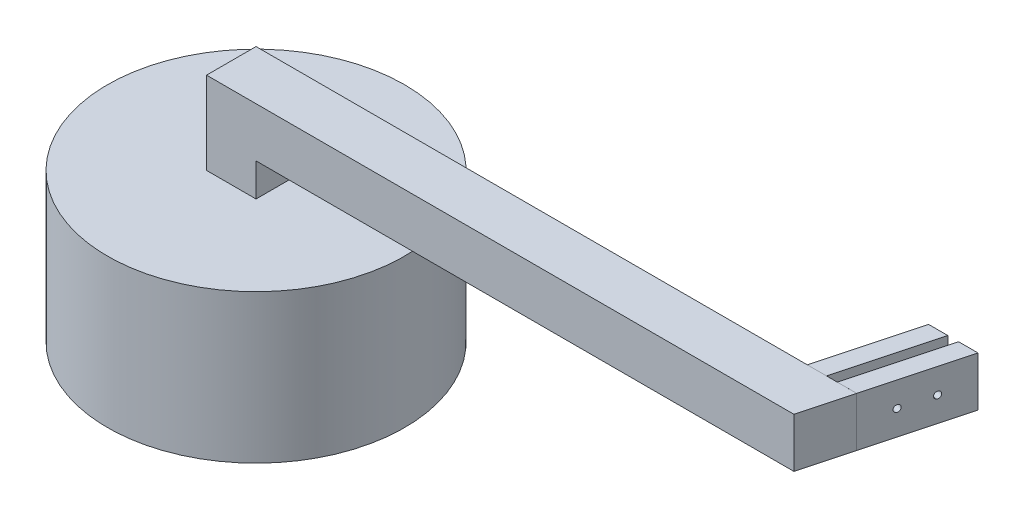
ISO-10303-21;
HEADER;
FILE_DESCRIPTION(('STEP AP214'),'2;1');
FILE_NAME('part.step','',(''),(''),'','','');
FILE_SCHEMA(('AUTOMOTIVE_DESIGN { 1 0 10303 214 1 1 1 1 }'));
ENDSEC;
DATA;
#1=APPLICATION_CONTEXT('core data for automotive mechanical design processes');
#2=APPLICATION_PROTOCOL_DEFINITION('international standard','automotive_design',2000,#1);
#3=PRODUCT_CONTEXT('',#1,'mechanical');
#4=PRODUCT('Part','Part','',(#3));
#5=PRODUCT_RELATED_PRODUCT_CATEGORY('part','',(#4));
#6=PRODUCT_DEFINITION_FORMATION('','',#4);
#7=PRODUCT_DEFINITION_CONTEXT('part definition',#1,'design');
#8=PRODUCT_DEFINITION('design','',#6,#7);
#9=PRODUCT_DEFINITION_SHAPE('','',#8);
#10=(LENGTH_UNIT() NAMED_UNIT(*) SI_UNIT(.MILLI.,.METRE.));
#11=(NAMED_UNIT(*) PLANE_ANGLE_UNIT() SI_UNIT($,.RADIAN.));
#12=(NAMED_UNIT(*) SI_UNIT($,.STERADIAN.) SOLID_ANGLE_UNIT());
#13=UNCERTAINTY_MEASURE_WITH_UNIT(LENGTH_MEASURE(1.E-05),#10,'distance_accuracy_value','');
#14=(GEOMETRIC_REPRESENTATION_CONTEXT(3) GLOBAL_UNCERTAINTY_ASSIGNED_CONTEXT((#13)) GLOBAL_UNIT_ASSIGNED_CONTEXT((#10,
#11,#12)) REPRESENTATION_CONTEXT('',''));
#15=CARTESIAN_POINT('',(0.,0.,0.));
#16=DIRECTION('',(0.,0.,1.));
#17=DIRECTION('',(1.,0.,0.));
#18=AXIS2_PLACEMENT_3D('',#15,#16,#17);
#19=CARTESIAN_POINT('',(364.499394286732,110.,-72.955549577344));
#20=DIRECTION('',(0.,1.,0.));
#21=DIRECTION('',(0.,0.,1.));
#22=AXIS2_PLACEMENT_3D('',#19,#20,#21);
#23=PLANE('',#22);
#24=DIRECTION('',(-1.,0.,0.));
#25=VECTOR('',#24,1.);
#26=CARTESIAN_POINT('',(364.499394286732,110.,-72.955549577344));
#27=LINE('',#26,#25);
#28=CARTESIAN_POINT('',(346.21239241393,110.,-72.955549577344));
#29=VERTEX_POINT('',#28);
#30=CARTESIAN_POINT('',(334.499394286732,110.,-72.955549577344));
#31=VERTEX_POINT('',#30);
#32=EDGE_CURVE('E87',#29,#31,#27,.T.);
#33=ORIENTED_EDGE('',*,*,#32,.F.);
#34=DIRECTION('',(-0.258819045102523,0.,0.965925826289068));
#35=VECTOR('',#34,1.);
#36=CARTESIAN_POINT('',(330.683249707778,110.,-15.));
#37=LINE('',#36,#35);
#38=CARTESIAN_POINT('',(330.683249707778,110.,-15.));
#39=VERTEX_POINT('',#38);
#40=EDGE_CURVE('E112',#29,#39,#37,.T.);
#41=ORIENTED_EDGE('',*,*,#40,.T.);
#42=DIRECTION('',(-1.,0.,0.));
#43=VECTOR('',#42,1.);
#44=CARTESIAN_POINT('',(348.97025158058,110.,-15.));
#45=LINE('',#44,#43);
#46=CARTESIAN_POINT('',(318.97025158058,110.,-15.));
#47=VERTEX_POINT('',#46);
#48=EDGE_CURVE('E96',#39,#47,#45,.T.);
#49=ORIENTED_EDGE('',*,*,#48,.T.);
#50=DIRECTION('',(-0.258819045102525,0.,0.965925826289067));
#51=VECTOR('',#50,1.);
#52=CARTESIAN_POINT('',(334.499394286732,110.,-72.955549577344));
#53=LINE('',#52,#51);
#54=EDGE_CURVE('E94',#31,#47,#53,.T.);
#55=ORIENTED_EDGE('',*,*,#54,.F.);
#56=EDGE_LOOP('',(#33,#41,#49,#55));
#57=FACE_BOUND('',#56,.T.);
#58=ADVANCED_FACE('F45',(#57),#23,.F.);
#59=CARTESIAN_POINT('',(364.499394286732,140.,-72.955549577344));
#60=DIRECTION('',(0.,-1.,0.));
#61=DIRECTION('',(0.,0.,-1.));
#62=AXIS2_PLACEMENT_3D('',#59,#60,#61);
#63=PLANE('',#62);
#64=DIRECTION('',(1.,0.,0.));
#65=VECTOR('',#64,1.);
#66=CARTESIAN_POINT('',(348.97025158058,140.,-15.));
#67=LINE('',#66,#65);
#68=CARTESIAN_POINT('',(318.97025158058,140.,-15.));
#69=VERTEX_POINT('',#68);
#70=CARTESIAN_POINT('',(330.683249707778,140.,-15.));
#71=VERTEX_POINT('',#70);
#72=EDGE_CURVE('E115',#69,#71,#67,.T.);
#73=ORIENTED_EDGE('',*,*,#72,.T.);
#74=DIRECTION('',(-0.258819045102523,0.,0.965925826289068));
#75=VECTOR('',#74,1.);
#76=CARTESIAN_POINT('',(330.683249707778,140.,-15.));
#77=LINE('',#76,#75);
#78=CARTESIAN_POINT('',(346.21239241393,140.,-72.955549577344));
#79=VERTEX_POINT('',#78);
#80=EDGE_CURVE('E54',#79,#71,#77,.T.);
#81=ORIENTED_EDGE('',*,*,#80,.F.);
#82=DIRECTION('',(1.,0.,0.));
#83=VECTOR('',#82,1.);
#84=CARTESIAN_POINT('',(364.499394286732,140.,-72.955549577344));
#85=LINE('',#84,#83);
#86=CARTESIAN_POINT('',(334.499394286732,140.,-72.955549577344));
#87=VERTEX_POINT('',#86);
#88=EDGE_CURVE('E104',#87,#79,#85,.T.);
#89=ORIENTED_EDGE('',*,*,#88,.F.);
#90=DIRECTION('',(-0.258819045102525,0.,0.965925826289067));
#91=VECTOR('',#90,1.);
#92=CARTESIAN_POINT('',(334.499394286732,140.,-72.955549577344));
#93=LINE('',#92,#91);
#94=EDGE_CURVE('E91',#87,#69,#93,.T.);
#95=ORIENTED_EDGE('',*,*,#94,.T.);
#96=EDGE_LOOP('',(#73,#81,#89,#95));
#97=FACE_BOUND('',#96,.T.);
#98=ADVANCED_FACE('F132',(#97),#63,.F.);
#99=CARTESIAN_POINT('',(15.5291427061515,0.,-72.955549577344));
#100=DIRECTION('',(0.,0.,-1.));
#101=DIRECTION('',(-1.,0.,0.));
#102=AXIS2_PLACEMENT_3D('',#99,#100,#101);
#103=PLANE('',#102);
#104=DIRECTION('',(0.,1.,0.));
#105=VECTOR('',#104,1.);
#106=CARTESIAN_POINT('',(346.21239241393,110.,-72.955549577344));
#107=LINE('',#106,#105);
#108=EDGE_CURVE('E12',#29,#79,#107,.T.);
#109=ORIENTED_EDGE('',*,*,#108,.F.);
#110=ORIENTED_EDGE('',*,*,#32,.T.);
#111=DIRECTION('',(0.,1.,0.));
#112=VECTOR('',#111,1.);
#113=CARTESIAN_POINT('',(334.499394286732,140.,-72.955549577344));
#114=LINE('',#113,#112);
#115=EDGE_CURVE('E84',#31,#87,#114,.T.);
#116=ORIENTED_EDGE('',*,*,#115,.T.);
#117=ORIENTED_EDGE('',*,*,#88,.T.);
#118=EDGE_LOOP('',(#109,#110,#116,#117));
#119=FACE_BOUND('',#118,.T.);
#120=ADVANCED_FACE('F89',(#119),#103,.T.);
#121=CARTESIAN_POINT('',(0.,0.,-15.));
#122=DIRECTION('',(0.,0.,-1.));
#123=DIRECTION('',(-1.,0.,0.));
#124=AXIS2_PLACEMENT_3D('',#121,#122,#123);
#125=PLANE('',#124);
#126=ORIENTED_EDGE('',*,*,#48,.F.);
#127=DIRECTION('',(0.,1.,0.));
#128=VECTOR('',#127,1.);
#129=CARTESIAN_POINT('',(330.683249707778,110.,-15.));
#130=LINE('',#129,#128);
#131=EDGE_CURVE('E69',#39,#71,#130,.T.);
#132=ORIENTED_EDGE('',*,*,#131,.T.);
#133=ORIENTED_EDGE('',*,*,#72,.F.);
#134=DIRECTION('',(0.,1.,0.));
#135=VECTOR('',#134,1.);
#136=CARTESIAN_POINT('',(318.97025158058,140.,-15.));
#137=LINE('',#136,#135);
#138=EDGE_CURVE('E99',#47,#69,#137,.T.);
#139=ORIENTED_EDGE('',*,*,#138,.F.);
#140=EDGE_LOOP('',(#126,#132,#133,#139));
#141=FACE_BOUND('',#140,.T.);
#142=ADVANCED_FACE('F134',(#141),#125,.F.);
#143=CARTESIAN_POINT('',(334.499394286732,140.,-72.955549577344));
#144=DIRECTION('',(0.965925826289067,0.,0.258819045102525));
#145=DIRECTION('',(0.258819045102525,0.,-0.965925826289067));
#146=AXIS2_PLACEMENT_3D('',#143,#144,#145);
#147=PLANE('',#146);
#148=CARTESIAN_POINT('',(331.332632327915,125.,-61.1370330515628));
#149=DIRECTION('',(0.965925826289067,0.,0.258819045102525));
#150=DIRECTION('',(0.258819045102525,0.,-0.965925826289067));
#151=AXIS2_PLACEMENT_3D('',#148,#149,#150);
#152=CIRCLE('',#151,2.01929999999995);
#153=CARTESIAN_POINT('',(331.85526562569,125.,-63.0875270725883));
#154=VERTEX_POINT('',#153);
#155=EDGE_CURVE('E120',#154,#154,#152,.T.);
#156=ORIENTED_EDGE('',*,*,#155,.T.);
#157=EDGE_LOOP('',(#156));
#158=FACE_BOUND('',#157,.T.);
#159=CARTESIAN_POINT('',(326.156251425864,125.,-41.8185165257815));
#160=DIRECTION('',(0.965925826289067,0.,0.258819045102525));
#161=DIRECTION('',(0.258819045102525,0.,-0.965925826289067));
#162=AXIS2_PLACEMENT_3D('',#159,#160,#161);
#163=CIRCLE('',#162,2.01929999999995);
#164=CARTESIAN_POINT('',(326.67888472364,125.,-43.7690105468069));
#165=VERTEX_POINT('',#164);
#166=EDGE_CURVE('E113',#165,#165,#163,.T.);
#167=ORIENTED_EDGE('',*,*,#166,.T.);
#168=EDGE_LOOP('',(#167));
#169=FACE_BOUND('',#168,.T.);
#170=ORIENTED_EDGE('',*,*,#138,.T.);
#171=ORIENTED_EDGE('',*,*,#94,.F.);
#172=ORIENTED_EDGE('',*,*,#115,.F.);
#173=ORIENTED_EDGE('',*,*,#54,.T.);
#174=EDGE_LOOP('',(#170,#171,#172,#173));
#175=FACE_BOUND('',#174,.T.);
#176=ADVANCED_FACE('F101',(#158,#169,#175),#147,.F.);
#177=CARTESIAN_POINT('',(330.683249707778,110.,-15.));
#178=DIRECTION('',(-0.965925826289068,0.,-0.258819045102523));
#179=DIRECTION('',(-0.258819045102523,0.,0.965925826289068));
#180=AXIS2_PLACEMENT_3D('',#177,#178,#179);
#181=PLANE('',#180);
#182=CARTESIAN_POINT('',(342.26100835783,125.,-58.2087835197633));
#183=DIRECTION('',(-0.965925826289068,0.,-0.258819045102523));
#184=DIRECTION('',(-0.258819045102523,0.,0.965925826289068));
#185=AXIS2_PLACEMENT_3D('',#182,#183,#184);
#186=CIRCLE('',#185,2.01929999999995);
#187=CARTESIAN_POINT('',(341.738375060055,125.,-56.2582894987378));
#188=VERTEX_POINT('',#187);
#189=EDGE_CURVE('E48',#188,#188,#186,.T.);
#190=ORIENTED_EDGE('',*,*,#189,.T.);
#191=EDGE_LOOP('',(#190));
#192=FACE_BOUND('',#191,.T.);
#193=CARTESIAN_POINT('',(337.08462745578,125.,-38.8902669939819));
#194=DIRECTION('',(-0.965925826289068,0.,-0.258819045102523));
#195=DIRECTION('',(-0.258819045102523,0.,0.965925826289068));
#196=AXIS2_PLACEMENT_3D('',#193,#194,#195);
#197=CIRCLE('',#196,2.01929999999995);
#198=CARTESIAN_POINT('',(336.561994158004,125.,-36.9397729729565));
#199=VERTEX_POINT('',#198);
#200=EDGE_CURVE('E118',#199,#199,#197,.T.);
#201=ORIENTED_EDGE('',*,*,#200,.T.);
#202=EDGE_LOOP('',(#201));
#203=FACE_BOUND('',#202,.T.);
#204=ORIENTED_EDGE('',*,*,#80,.T.);
#205=ORIENTED_EDGE('',*,*,#131,.F.);
#206=ORIENTED_EDGE('',*,*,#40,.F.);
#207=ORIENTED_EDGE('',*,*,#108,.T.);
#208=EDGE_LOOP('',(#204,#205,#206,#207));
#209=FACE_BOUND('',#208,.T.);
#210=ADVANCED_FACE('F141',(#192,#203,#209),#181,.F.);
#211=CARTESIAN_POINT('',(354.146632482631,125.,-34.3185165257814));
#212=DIRECTION('',(0.965925826289068,0.,0.258819045102524));
#213=DIRECTION('',(0.258819045102524,0.,-0.965925826289068));
#214=AXIS2_PLACEMENT_3D('',#211,#212,#213);
#215=CYLINDRICAL_SURFACE('',#214,2.01929999999995);
#216=ORIENTED_EDGE('',*,*,#200,.F.);
#217=EDGE_LOOP('',(#216));
#218=FACE_BOUND('',#217,.T.);
#219=ORIENTED_EDGE('',*,*,#166,.F.);
#220=EDGE_LOOP('',(#219));
#221=FACE_BOUND('',#220,.T.);
#222=ADVANCED_FACE('F174',(#218,#221),#215,.F.);
#223=CARTESIAN_POINT('',(359.323013384681,125.,-53.6370330515627));
#224=DIRECTION('',(0.965925826289068,0.,0.258819045102524));
#225=DIRECTION('',(0.258819045102524,0.,-0.965925826289068));
#226=AXIS2_PLACEMENT_3D('',#223,#224,#225);
#227=CYLINDRICAL_SURFACE('',#226,2.01929999999995);
#228=ORIENTED_EDGE('',*,*,#189,.F.);
#229=EDGE_LOOP('',(#228));
#230=FACE_BOUND('',#229,.T.);
#231=ORIENTED_EDGE('',*,*,#155,.F.);
#232=EDGE_LOOP('',(#231));
#233=FACE_BOUND('',#232,.T.);
#234=ADVANCED_FACE('F184',(#230,#233),#227,.F.);
#235=CLOSED_SHELL('',(#58,#98,#120,#142,#176,#210,#222,#234));
#236=MANIFOLD_SOLID_BREP('B2',#235);
#237=CARTESIAN_POINT('',(364.499394286732,140.,-72.955549577344));
#238=DIRECTION('',(-0.965925826289067,0.,-0.258819045102525));
#239=DIRECTION('',(-0.258819045102525,0.,0.965925826289067));
#240=AXIS2_PLACEMENT_3D('',#237,#238,#239);
#241=PLANE('',#240);
#242=CARTESIAN_POINT('',(359.323013384681,125.,-53.6370330515627));
#243=DIRECTION('',(0.965925826289068,0.,0.258819045102524));
#244=DIRECTION('',(0.258819045102524,0.,-0.965925826289068));
#245=AXIS2_PLACEMENT_3D('',#242,#243,#244);
#246=CIRCLE('',#245,2.0193);
#247=CARTESIAN_POINT('',(359.845646682457,125.,-55.5875270725882));
#248=VERTEX_POINT('',#247);
#249=EDGE_CURVE('E300',#248,#248,#246,.T.);
#250=ORIENTED_EDGE('',*,*,#249,.F.);
#251=EDGE_LOOP('',(#250));
#252=FACE_BOUND('',#251,.T.);
#253=CARTESIAN_POINT('',(354.146632482631,125.,-34.3185165257814));
#254=DIRECTION('',(0.965925826289068,0.,0.258819045102524));
#255=DIRECTION('',(0.258819045102524,0.,-0.965925826289068));
#256=AXIS2_PLACEMENT_3D('',#253,#254,#255);
#257=CIRCLE('',#256,2.0193);
#258=CARTESIAN_POINT('',(354.669265780406,125.,-36.2690105468069));
#259=VERTEX_POINT('',#258);
#260=EDGE_CURVE('E294',#259,#259,#257,.T.);
#261=ORIENTED_EDGE('',*,*,#260,.F.);
#262=EDGE_LOOP('',(#261));
#263=FACE_BOUND('',#262,.T.);
#264=DIRECTION('',(0.,-1.,0.));
#265=VECTOR('',#264,1.);
#266=CARTESIAN_POINT('',(348.97025158058,140.,-15.));
#267=LINE('',#266,#265);
#268=CARTESIAN_POINT('',(348.97025158058,140.,-15.));
#269=VERTEX_POINT('',#268);
#270=CARTESIAN_POINT('',(348.97025158058,110.,-15.));
#271=VERTEX_POINT('',#270);
#272=EDGE_CURVE('E276',#269,#271,#267,.T.);
#273=ORIENTED_EDGE('',*,*,#272,.T.);
#274=DIRECTION('',(-0.258819045102525,0.,0.965925826289067));
#275=VECTOR('',#274,1.);
#276=CARTESIAN_POINT('',(364.499394286732,110.,-72.955549577344));
#277=LINE('',#276,#275);
#278=CARTESIAN_POINT('',(364.499394286732,110.,-72.955549577344));
#279=VERTEX_POINT('',#278);
#280=EDGE_CURVE('E43',#279,#271,#277,.T.);
#281=ORIENTED_EDGE('',*,*,#280,.F.);
#282=DIRECTION('',(0.,-1.,0.));
#283=VECTOR('',#282,1.);
#284=CARTESIAN_POINT('',(364.499394286732,140.,-72.955549577344));
#285=LINE('',#284,#283);
#286=CARTESIAN_POINT('',(364.499394286732,140.,-72.955549577344));
#287=VERTEX_POINT('',#286);
#288=EDGE_CURVE('E270',#287,#279,#285,.T.);
#289=ORIENTED_EDGE('',*,*,#288,.F.);
#290=DIRECTION('',(-0.258819045102525,0.,0.965925826289067));
#291=VECTOR('',#290,1.);
#292=CARTESIAN_POINT('',(364.499394286732,140.,-72.955549577344));
#293=LINE('',#292,#291);
#294=EDGE_CURVE('E231',#287,#269,#293,.T.);
#295=ORIENTED_EDGE('',*,*,#294,.T.);
#296=EDGE_LOOP('',(#273,#281,#289,#295));
#297=FACE_BOUND('',#296,.T.);
#298=ADVANCED_FACE('F223',(#252,#263,#297),#241,.F.);
#299=CARTESIAN_POINT('',(0.,0.,-15.));
#300=DIRECTION('',(0.,0.,-1.));
#301=DIRECTION('',(-1.,0.,0.));
#302=AXIS2_PLACEMENT_3D('',#299,#300,#301);
#303=PLANE('',#302);
#304=DIRECTION('',(1.,0.,0.));
#305=VECTOR('',#304,1.);
#306=CARTESIAN_POINT('',(348.97025158058,140.,-15.));
#307=LINE('',#306,#305);
#308=CARTESIAN_POINT('',(337.257253453383,140.,-15.));
#309=VERTEX_POINT('',#308);
#310=EDGE_CURVE('E261',#309,#269,#307,.T.);
#311=ORIENTED_EDGE('',*,*,#310,.F.);
#312=DIRECTION('',(0.,1.,0.));
#313=VECTOR('',#312,1.);
#314=CARTESIAN_POINT('',(337.257253453383,110.,-15.));
#315=LINE('',#314,#313);
#316=CARTESIAN_POINT('',(337.257253453383,110.,-15.));
#317=VERTEX_POINT('',#316);
#318=EDGE_CURVE('E283',#317,#309,#315,.T.);
#319=ORIENTED_EDGE('',*,*,#318,.F.);
#320=DIRECTION('',(-1.,0.,0.));
#321=VECTOR('',#320,1.);
#322=CARTESIAN_POINT('',(348.97025158058,110.,-15.));
#323=LINE('',#322,#321);
#324=EDGE_CURVE('E271',#271,#317,#323,.T.);
#325=ORIENTED_EDGE('',*,*,#324,.F.);
#326=ORIENTED_EDGE('',*,*,#272,.F.);
#327=EDGE_LOOP('',(#311,#319,#325,#326));
#328=FACE_BOUND('',#327,.T.);
#329=ADVANCED_FACE('F278',(#328),#303,.F.);
#330=CARTESIAN_POINT('',(15.5291427061515,0.,-72.955549577344));
#331=DIRECTION('',(0.,0.,-1.));
#332=DIRECTION('',(-1.,0.,0.));
#333=AXIS2_PLACEMENT_3D('',#330,#331,#332);
#334=PLANE('',#333);
#335=DIRECTION('',(0.,1.,0.));
#336=VECTOR('',#335,1.);
#337=CARTESIAN_POINT('',(352.786396159534,110.,-72.955549577344));
#338=LINE('',#337,#336);
#339=CARTESIAN_POINT('',(352.786396159534,110.,-72.955549577344));
#340=VERTEX_POINT('',#339);
#341=CARTESIAN_POINT('',(352.786396159534,140.,-72.955549577344));
#342=VERTEX_POINT('',#341);
#343=EDGE_CURVE('E280',#340,#342,#338,.T.);
#344=ORIENTED_EDGE('',*,*,#343,.T.);
#345=DIRECTION('',(1.,0.,0.));
#346=VECTOR('',#345,1.);
#347=CARTESIAN_POINT('',(364.499394286732,140.,-72.955549577344));
#348=LINE('',#347,#346);
#349=EDGE_CURVE('E247',#342,#287,#348,.T.);
#350=ORIENTED_EDGE('',*,*,#349,.T.);
#351=ORIENTED_EDGE('',*,*,#288,.T.);
#352=DIRECTION('',(-1.,0.,0.));
#353=VECTOR('',#352,1.);
#354=CARTESIAN_POINT('',(364.499394286732,110.,-72.955549577344));
#355=LINE('',#354,#353);
#356=EDGE_CURVE('E287',#279,#340,#355,.T.);
#357=ORIENTED_EDGE('',*,*,#356,.T.);
#358=EDGE_LOOP('',(#344,#350,#351,#357));
#359=FACE_BOUND('',#358,.T.);
#360=ADVANCED_FACE('F324',(#359),#334,.T.);
#361=CARTESIAN_POINT('',(364.499394286732,140.,-72.955549577344));
#362=DIRECTION('',(0.,-1.,0.));
#363=DIRECTION('',(0.,0.,-1.));
#364=AXIS2_PLACEMENT_3D('',#361,#362,#363);
#365=PLANE('',#364);
#366=ORIENTED_EDGE('',*,*,#349,.F.);
#367=DIRECTION('',(0.258819045102523,0.,-0.965925826289068));
#368=VECTOR('',#367,1.);
#369=CARTESIAN_POINT('',(337.257253453383,140.,-15.));
#370=LINE('',#369,#368);
#371=EDGE_CURVE('E267',#309,#342,#370,.T.);
#372=ORIENTED_EDGE('',*,*,#371,.F.);
#373=ORIENTED_EDGE('',*,*,#310,.T.);
#374=ORIENTED_EDGE('',*,*,#294,.F.);
#375=EDGE_LOOP('',(#366,#372,#373,#374));
#376=FACE_BOUND('',#375,.T.);
#377=ADVANCED_FACE('F263',(#376),#365,.F.);
#378=CARTESIAN_POINT('',(364.499394286732,110.,-72.955549577344));
#379=DIRECTION('',(0.,1.,0.));
#380=DIRECTION('',(0.,0.,1.));
#381=AXIS2_PLACEMENT_3D('',#378,#379,#380);
#382=PLANE('',#381);
#383=ORIENTED_EDGE('',*,*,#324,.T.);
#384=DIRECTION('',(0.258819045102523,0.,-0.965925826289068));
#385=VECTOR('',#384,1.);
#386=CARTESIAN_POINT('',(337.257253453383,110.,-15.));
#387=LINE('',#386,#385);
#388=EDGE_CURVE('E238',#317,#340,#387,.T.);
#389=ORIENTED_EDGE('',*,*,#388,.T.);
#390=ORIENTED_EDGE('',*,*,#356,.F.);
#391=ORIENTED_EDGE('',*,*,#280,.T.);
#392=EDGE_LOOP('',(#383,#389,#390,#391));
#393=FACE_BOUND('',#392,.T.);
#394=ADVANCED_FACE('F320',(#393),#382,.F.);
#395=CARTESIAN_POINT('',(337.257253453383,110.,-15.));
#396=DIRECTION('',(0.965925826289068,0.,0.258819045102523));
#397=DIRECTION('',(0.258819045102523,0.,-0.965925826289068));
#398=AXIS2_PLACEMENT_3D('',#395,#396,#397);
#399=PLANE('',#398);
#400=CARTESIAN_POINT('',(348.394637354766,125.,-56.5652825833623));
#401=DIRECTION('',(0.965925826289068,0.,0.258819045102523));
#402=DIRECTION('',(0.258819045102523,0.,-0.965925826289068));
#403=AXIS2_PLACEMENT_3D('',#400,#401,#402);
#404=CIRCLE('',#403,2.01929999999995);
#405=CARTESIAN_POINT('',(348.917270652541,125.,-58.5157766043877));
#406=VERTEX_POINT('',#405);
#407=EDGE_CURVE('E297',#406,#406,#404,.T.);
#408=ORIENTED_EDGE('',*,*,#407,.T.);
#409=EDGE_LOOP('',(#408));
#410=FACE_BOUND('',#409,.T.);
#411=CARTESIAN_POINT('',(343.218256452715,125.,-37.2467660575809));
#412=DIRECTION('',(0.965925826289068,0.,0.258819045102523));
#413=DIRECTION('',(0.258819045102523,0.,-0.965925826289068));
#414=AXIS2_PLACEMENT_3D('',#411,#412,#413);
#415=CIRCLE('',#414,2.01929999999995);
#416=CARTESIAN_POINT('',(343.740889750491,125.,-39.1972600786063));
#417=VERTEX_POINT('',#416);
#418=EDGE_CURVE('E226',#417,#417,#415,.T.);
#419=ORIENTED_EDGE('',*,*,#418,.T.);
#420=EDGE_LOOP('',(#419));
#421=FACE_BOUND('',#420,.T.);
#422=ORIENTED_EDGE('',*,*,#371,.T.);
#423=ORIENTED_EDGE('',*,*,#343,.F.);
#424=ORIENTED_EDGE('',*,*,#388,.F.);
#425=ORIENTED_EDGE('',*,*,#318,.T.);
#426=EDGE_LOOP('',(#422,#423,#424,#425));
#427=FACE_BOUND('',#426,.T.);
#428=ADVANCED_FACE('F314',(#410,#421,#427),#399,.F.);
#429=CARTESIAN_POINT('',(354.146632482631,125.,-34.3185165257814));
#430=DIRECTION('',(0.965925826289068,0.,0.258819045102524));
#431=DIRECTION('',(0.258819045102524,0.,-0.965925826289068));
#432=AXIS2_PLACEMENT_3D('',#429,#430,#431);
#433=CYLINDRICAL_SURFACE('',#432,2.01929999999995);
#434=ORIENTED_EDGE('',*,*,#260,.T.);
#435=EDGE_LOOP('',(#434));
#436=FACE_BOUND('',#435,.T.);
#437=ORIENTED_EDGE('',*,*,#418,.F.);
#438=EDGE_LOOP('',(#437));
#439=FACE_BOUND('',#438,.T.);
#440=ADVANCED_FACE('F311',(#436,#439),#433,.F.);
#441=CARTESIAN_POINT('',(359.323013384681,125.,-53.6370330515627));
#442=DIRECTION('',(0.965925826289068,0.,0.258819045102524));
#443=DIRECTION('',(0.258819045102524,0.,-0.965925826289068));
#444=AXIS2_PLACEMENT_3D('',#441,#442,#443);
#445=CYLINDRICAL_SURFACE('',#444,2.01929999999995);
#446=ORIENTED_EDGE('',*,*,#249,.T.);
#447=EDGE_LOOP('',(#446));
#448=FACE_BOUND('',#447,.T.);
#449=ORIENTED_EDGE('',*,*,#407,.F.);
#450=EDGE_LOOP('',(#449));
#451=FACE_BOUND('',#450,.T.);
#452=ADVANCED_FACE('F304',(#448,#451),#445,.F.);
#453=CLOSED_SHELL('',(#298,#329,#360,#377,#394,#428,#440,#452));
#454=MANIFOLD_SOLID_BREP('B6',#453);
#455=CARTESIAN_POINT('',(15.,140.,-15.));
#456=DIRECTION('',(-1.,0.,0.));
#457=DIRECTION('',(0.,0.,1.));
#458=AXIS2_PLACEMENT_3D('',#455,#456,#457);
#459=PLANE('',#458);
#460=DIRECTION('',(0.,0.,-1.));
#461=VECTOR('',#460,1.);
#462=CARTESIAN_POINT('',(15.,110.,15.));
#463=LINE('',#462,#461);
#464=CARTESIAN_POINT('',(15.,110.,15.));
#465=VERTEX_POINT('',#464);
#466=CARTESIAN_POINT('',(15.,110.,-15.));
#467=VERTEX_POINT('',#466);
#468=EDGE_CURVE('E441',#465,#467,#463,.T.);
#469=ORIENTED_EDGE('',*,*,#468,.F.);
#470=DIRECTION('',(0.,-1.,0.));
#471=VECTOR('',#470,1.);
#472=CARTESIAN_POINT('',(15.,140.,15.));
#473=LINE('',#472,#471);
#474=CARTESIAN_POINT('',(15.,90.,15.));
#475=VERTEX_POINT('',#474);
#476=EDGE_CURVE('E434',#465,#475,#473,.T.);
#477=ORIENTED_EDGE('',*,*,#476,.T.);
#478=DIRECTION('',(0.,0.,-1.));
#479=VECTOR('',#478,1.);
#480=CARTESIAN_POINT('',(15.,90.,-15.));
#481=LINE('',#480,#479);
#482=CARTESIAN_POINT('',(15.,90.,-15.));
#483=VERTEX_POINT('',#482);
#484=EDGE_CURVE('E437',#475,#483,#481,.T.);
#485=ORIENTED_EDGE('',*,*,#484,.T.);
#486=DIRECTION('',(0.,-1.,0.));
#487=VECTOR('',#486,1.);
#488=CARTESIAN_POINT('',(15.,140.,-15.));
#489=LINE('',#488,#487);
#490=EDGE_CURVE('E469',#467,#483,#489,.T.);
#491=ORIENTED_EDGE('',*,*,#490,.F.);
#492=EDGE_LOOP('',(#469,#477,#485,#491));
#493=FACE_BOUND('',#492,.T.);
#494=ADVANCED_FACE('F392',(#493),#459,.F.);
#495=CARTESIAN_POINT('',(0.,90.,0.));
#496=DIRECTION('',(0.,1.,0.));
#497=DIRECTION('',(0.,0.,1.));
#498=AXIS2_PLACEMENT_3D('',#495,#496,#497);
#499=PLANE('',#498);
#500=CARTESIAN_POINT('',(0.,90.,0.));
#501=DIRECTION('',(0.,1.,0.));
#502=DIRECTION('',(0.,0.,1.));
#503=AXIS2_PLACEMENT_3D('',#500,#501,#502);
#504=CIRCLE('',#503,90.);
#505=CARTESIAN_POINT('',(0.,90.,-90.));
#506=VERTEX_POINT('',#505);
#507=EDGE_CURVE('E221',#506,#506,#504,.T.);
#508=ORIENTED_EDGE('',*,*,#507,.T.);
#509=EDGE_LOOP('',(#508));
#510=FACE_BOUND('',#509,.T.);
#511=DIRECTION('',(-1.,0.,0.));
#512=VECTOR('',#511,1.);
#513=CARTESIAN_POINT('',(-15.,90.,-15.));
#514=LINE('',#513,#512);
#515=CARTESIAN_POINT('',(-15.,90.,-15.));
#516=VERTEX_POINT('',#515);
#517=EDGE_CURVE('E454',#483,#516,#514,.T.);
#518=ORIENTED_EDGE('',*,*,#517,.F.);
#519=ORIENTED_EDGE('',*,*,#484,.F.);
#520=DIRECTION('',(1.,0.,0.));
#521=VECTOR('',#520,1.);
#522=CARTESIAN_POINT('',(-15.,90.,15.));
#523=LINE('',#522,#521);
#524=CARTESIAN_POINT('',(-15.,90.,15.));
#525=VERTEX_POINT('',#524);
#526=EDGE_CURVE('E446',#525,#475,#523,.T.);
#527=ORIENTED_EDGE('',*,*,#526,.F.);
#528=DIRECTION('',(0.,0.,1.));
#529=VECTOR('',#528,1.);
#530=CARTESIAN_POINT('',(-15.,90.,-15.));
#531=LINE('',#530,#529);
#532=EDGE_CURVE('E451',#516,#525,#531,.T.);
#533=ORIENTED_EDGE('',*,*,#532,.F.);
#534=EDGE_LOOP('',(#518,#519,#527,#533));
#535=FACE_BOUND('',#534,.T.);
#536=ADVANCED_FACE('F453',(#510,#535),#499,.T.);
#537=CARTESIAN_POINT('',(0.,90.,0.));
#538=DIRECTION('',(0.,-1.,0.));
#539=DIRECTION('',(0.,0.,-1.));
#540=AXIS2_PLACEMENT_3D('',#537,#538,#539);
#541=CYLINDRICAL_SURFACE('',#540,90.);
#542=CARTESIAN_POINT('',(0.,0.,0.));
#543=DIRECTION('',(0.,1.,0.));
#544=DIRECTION('',(0.,0.,1.));
#545=AXIS2_PLACEMENT_3D('',#542,#543,#544);
#546=CIRCLE('',#545,90.);
#547=CARTESIAN_POINT('',(0.,0.,-90.));
#548=VERTEX_POINT('',#547);
#549=EDGE_CURVE('E401',#548,#548,#546,.T.);
#550=CARTESIAN_POINT('',(0.,90.,-90.));
#551=CARTESIAN_POINT('',(0.,89.0625,-90.));
#552=CARTESIAN_POINT('',(0.,88.125,-90.));
#553=CARTESIAN_POINT('',(0.,86.25,-90.));
#554=CARTESIAN_POINT('',(0.,85.3125,-90.));
#555=CARTESIAN_POINT('',(0.,83.4375,-90.));
#556=CARTESIAN_POINT('',(0.,82.5,-90.));
#557=CARTESIAN_POINT('',(0.,80.625,-90.));
#558=CARTESIAN_POINT('',(0.,79.6875,-90.));
#559=CARTESIAN_POINT('',(0.,77.8125,-90.));
#560=CARTESIAN_POINT('',(0.,76.875,-90.));
#561=CARTESIAN_POINT('',(0.,75.,-90.));
#562=CARTESIAN_POINT('',(0.,74.0625,-90.));
#563=CARTESIAN_POINT('',(0.,72.1875,-90.));
#564=CARTESIAN_POINT('',(0.,71.25,-90.));
#565=CARTESIAN_POINT('',(0.,69.375,-90.));
#566=CARTESIAN_POINT('',(0.,68.4375,-90.));
#567=CARTESIAN_POINT('',(0.,66.5625,-90.));
#568=CARTESIAN_POINT('',(0.,65.625,-90.));
#569=CARTESIAN_POINT('',(0.,63.75,-90.));
#570=CARTESIAN_POINT('',(0.,62.8125,-90.));
#571=CARTESIAN_POINT('',(0.,60.9375,-90.));
#572=CARTESIAN_POINT('',(0.,60.,-90.));
#573=CARTESIAN_POINT('',(0.,58.125,-90.));
#574=CARTESIAN_POINT('',(0.,57.1875,-90.));
#575=CARTESIAN_POINT('',(0.,55.3125,-90.));
#576=CARTESIAN_POINT('',(0.,54.375,-90.));
#577=CARTESIAN_POINT('',(0.,52.5,-90.));
#578=CARTESIAN_POINT('',(0.,51.5625,-90.));
#579=CARTESIAN_POINT('',(0.,49.6875,-90.));
#580=CARTESIAN_POINT('',(0.,48.75,-90.));
#581=CARTESIAN_POINT('',(0.,46.875,-90.));
#582=CARTESIAN_POINT('',(0.,45.9375,-90.));
#583=CARTESIAN_POINT('',(0.,44.0625,-90.));
#584=CARTESIAN_POINT('',(0.,43.125,-90.));
#585=CARTESIAN_POINT('',(0.,41.25,-90.));
#586=CARTESIAN_POINT('',(0.,40.3125,-90.));
#587=CARTESIAN_POINT('',(0.,38.4375,-90.));
#588=CARTESIAN_POINT('',(0.,37.5,-90.));
#589=CARTESIAN_POINT('',(0.,35.625,-90.));
#590=CARTESIAN_POINT('',(0.,34.6875,-90.));
#591=CARTESIAN_POINT('',(0.,32.8125,-90.));
#592=CARTESIAN_POINT('',(0.,31.875,-90.));
#593=CARTESIAN_POINT('',(0.,30.,-90.));
#594=CARTESIAN_POINT('',(0.,29.0625,-90.));
#595=CARTESIAN_POINT('',(0.,27.1875,-90.));
#596=CARTESIAN_POINT('',(0.,26.25,-90.));
#597=CARTESIAN_POINT('',(0.,24.375,-90.));
#598=CARTESIAN_POINT('',(0.,23.4375,-90.));
#599=CARTESIAN_POINT('',(0.,21.5625,-90.));
#600=CARTESIAN_POINT('',(0.,20.625,-90.));
#601=CARTESIAN_POINT('',(0.,18.75,-90.));
#602=CARTESIAN_POINT('',(0.,17.8125,-90.));
#603=CARTESIAN_POINT('',(0.,15.9375,-90.));
#604=CARTESIAN_POINT('',(0.,15.,-90.));
#605=CARTESIAN_POINT('',(0.,13.125,-90.));
#606=CARTESIAN_POINT('',(0.,12.1875,-90.));
#607=CARTESIAN_POINT('',(0.,10.3125,-90.));
#608=CARTESIAN_POINT('',(0.,9.37499999999999,-90.));
#609=CARTESIAN_POINT('',(0.,7.49999999999999,-90.));
#610=CARTESIAN_POINT('',(0.,6.56249999999999,-90.));
#611=CARTESIAN_POINT('',(0.,4.68749999999999,-90.));
#612=CARTESIAN_POINT('',(0.,3.74999999999998,-90.));
#613=CARTESIAN_POINT('',(0.,1.87499999999998,-90.));
#614=CARTESIAN_POINT('',(0.,0.937499999999986,-90.));
#615=CARTESIAN_POINT('',(0.,0.,-90.));
#616=B_SPLINE_CURVE_WITH_KNOTS('',3,(#550,#551,#552,#553,#554,#555,#556,#557,#558,#559,#560,
#561,#562,#563,#564,#565,#566,#567,#568,#569,#570,#571,#572,#573,#574,#575,#576,#577,#578,#579,
#580,#581,#582,#583,#584,#585,#586,#587,#588,#589,#590,#591,#592,#593,#594,#595,#596,#597,#598,
#599,#600,#601,#602,#603,#604,#605,#606,#607,#608,#609,#610,#611,#612,#613,#614,#615),
.UNSPECIFIED.,.F.,.F.,(4,2,2,2,2,2,2,2,2,2,2,2,2,2,2,2,2,2,2,2,2,2,2,2,2,2,2,2,2,2,2,2,4),(0.,
2.81250000000001,5.62500000000001,8.43750000000001,11.25,14.0625,16.875,19.6875,22.5,25.3125,
28.125,30.9375,33.75,36.5625,39.375,42.1875,45.,47.8125,50.625,53.4375,56.25,59.0625,61.875,
64.6875,67.5,70.3125,73.125,75.9375,78.75,81.5625,84.375,87.1875,90.),.UNSPECIFIED.);
#617=EDGE_CURVE('BSEAM394',#506,#548,#616,.T.);
#618=ORIENTED_EDGE('',*,*,#507,.F.);
#619=ORIENTED_EDGE('',*,*,#549,.T.);
#620=ORIENTED_EDGE('',*,*,#617,.T.);
#621=ORIENTED_EDGE('',*,*,#617,.F.);
#622=EDGE_LOOP('',(#618,#620,#619,#621));
#623=FACE_BOUND('',#622,.T.);
#624=ADVANCED_FACE('F394',(#623),#541,.T.);
#625=CARTESIAN_POINT('',(0.,0.,0.));
#626=DIRECTION('',(0.,1.,0.));
#627=DIRECTION('',(0.,0.,1.));
#628=AXIS2_PLACEMENT_3D('',#625,#626,#627);
#629=PLANE('',#628);
#630=ORIENTED_EDGE('',*,*,#549,.F.);
#631=EDGE_LOOP('',(#630));
#632=FACE_BOUND('',#631,.T.);
#633=ADVANCED_FACE('F498',(#632),#629,.F.);
#634=CARTESIAN_POINT('',(-15.,140.,-15.));
#635=DIRECTION('',(0.,0.,1.));
#636=DIRECTION('',(1.,0.,0.));
#637=AXIS2_PLACEMENT_3D('',#634,#635,#636);
#638=PLANE('',#637);
#639=ORIENTED_EDGE('',*,*,#517,.T.);
#640=DIRECTION('',(0.,-1.,0.));
#641=VECTOR('',#640,1.);
#642=CARTESIAN_POINT('',(-15.,140.,-15.));
#643=LINE('',#642,#641);
#644=CARTESIAN_POINT('',(-15.,140.,-15.));
#645=VERTEX_POINT('',#644);
#646=EDGE_CURVE('E466',#645,#516,#643,.T.);
#647=ORIENTED_EDGE('',*,*,#646,.F.);
#648=DIRECTION('',(-1.,0.,0.));
#649=VECTOR('',#648,1.);
#650=CARTESIAN_POINT('',(-15.,140.,-15.));
#651=LINE('',#650,#649);
#652=CARTESIAN_POINT('',(135.,140.,-14.9981481227449));
#653=VERTEX_POINT('',#652);
#654=EDGE_CURVE('E450',#653,#645,#651,.T.);
#655=ORIENTED_EDGE('',*,*,#654,.F.);
#656=CARTESIAN_POINT('',(135.,110.,-14.9962962454898));
#657=DIRECTION('',(0.,1.,0.));
#658=VECTOR('',#657,1.);
#659=LINE('',#656,#658);
#660=CARTESIAN_POINT('',(135.,110.,-14.9981481227449));
#661=VERTEX_POINT('',#660);
#662=EDGE_CURVE('E480',#661,#653,#659,.T.);
#663=ORIENTED_EDGE('',*,*,#662,.F.);
#664=DIRECTION('',(-1.,0.,0.));
#665=VECTOR('',#664,1.);
#666=CARTESIAN_POINT('',(135.,110.,-15.));
#667=LINE('',#666,#665);
#668=EDGE_CURVE('E459',#661,#467,#667,.T.);
#669=ORIENTED_EDGE('',*,*,#668,.T.);
#670=ORIENTED_EDGE('',*,*,#490,.T.);
#671=EDGE_LOOP('',(#639,#647,#655,#663,#669,#670));
#672=FACE_BOUND('',#671,.T.);
#673=ADVANCED_FACE('F487',(#672),#638,.F.);
#674=CARTESIAN_POINT('',(-15.,140.,-15.));
#675=DIRECTION('',(1.,0.,0.));
#676=DIRECTION('',(0.,0.,-1.));
#677=AXIS2_PLACEMENT_3D('',#674,#675,#676);
#678=PLANE('',#677);
#679=ORIENTED_EDGE('',*,*,#532,.T.);
#680=DIRECTION('',(0.,-1.,0.));
#681=VECTOR('',#680,1.);
#682=CARTESIAN_POINT('',(-15.,140.,15.));
#683=LINE('',#682,#681);
#684=CARTESIAN_POINT('',(-15.,140.,15.));
#685=VERTEX_POINT('',#684);
#686=EDGE_CURVE('E409',#685,#525,#683,.T.);
#687=ORIENTED_EDGE('',*,*,#686,.F.);
#688=DIRECTION('',(0.,0.,1.));
#689=VECTOR('',#688,1.);
#690=CARTESIAN_POINT('',(-15.,140.,-15.));
#691=LINE('',#690,#689);
#692=EDGE_CURVE('E418',#645,#685,#691,.T.);
#693=ORIENTED_EDGE('',*,*,#692,.F.);
#694=ORIENTED_EDGE('',*,*,#646,.T.);
#695=EDGE_LOOP('',(#679,#687,#693,#694));
#696=FACE_BOUND('',#695,.T.);
#697=ADVANCED_FACE('F497',(#696),#678,.F.);
#698=CARTESIAN_POINT('',(-15.,140.,15.));
#699=DIRECTION('',(0.,0.,-1.));
#700=DIRECTION('',(-1.,0.,0.));
#701=AXIS2_PLACEMENT_3D('',#698,#699,#700);
#702=PLANE('',#701);
#703=ORIENTED_EDGE('',*,*,#526,.T.);
#704=ORIENTED_EDGE('',*,*,#476,.F.);
#705=DIRECTION('',(-1.,0.,0.));
#706=VECTOR('',#705,1.);
#707=CARTESIAN_POINT('',(135.,110.,15.));
#708=LINE('',#707,#706);
#709=CARTESIAN_POINT('',(340.932768225677,110.,15.));
#710=VERTEX_POINT('',#709);
#711=EDGE_CURVE('E455',#710,#465,#708,.T.);
#712=ORIENTED_EDGE('',*,*,#711,.F.);
#713=DIRECTION('',(0.,1.,0.));
#714=VECTOR('',#713,1.);
#715=CARTESIAN_POINT('',(340.932768225677,110.,15.));
#716=LINE('',#715,#714);
#717=CARTESIAN_POINT('',(340.932768225677,140.,15.));
#718=VERTEX_POINT('',#717);
#719=EDGE_CURVE('E603',#710,#718,#716,.T.);
#720=ORIENTED_EDGE('',*,*,#719,.T.);
#721=DIRECTION('',(1.,0.,0.));
#722=VECTOR('',#721,1.);
#723=CARTESIAN_POINT('',(-15.,140.,15.));
#724=LINE('',#723,#722);
#725=EDGE_CURVE('E443',#685,#718,#724,.T.);
#726=ORIENTED_EDGE('',*,*,#725,.F.);
#727=ORIENTED_EDGE('',*,*,#686,.T.);
#728=EDGE_LOOP('',(#703,#704,#712,#720,#726,#727));
#729=FACE_BOUND('',#728,.T.);
#730=ADVANCED_FACE('F447',(#729),#702,.F.);
#731=CARTESIAN_POINT('',(0.,140.,0.));
#732=DIRECTION('',(0.,1.,0.));
#733=DIRECTION('',(0.,0.,1.));
#734=AXIS2_PLACEMENT_3D('',#731,#732,#733);
#735=PLANE('',#734);
#736=ORIENTED_EDGE('',*,*,#725,.T.);
#737=DIRECTION('',(0.258819045102525,0.,-0.965925826289067));
#738=VECTOR('',#737,1.);
#739=CARTESIAN_POINT('',(348.97025158058,140.,-14.9962962454898));
#740=LINE('',#739,#738);
#741=CARTESIAN_POINT('',(348.97025158058,140.,-14.9962962454898));
#742=VERTEX_POINT('',#741);
#743=EDGE_CURVE('E610',#718,#742,#740,.T.);
#744=ORIENTED_EDGE('',*,*,#743,.T.);
#745=DIRECTION('',(-1.,0.,0.));
#746=VECTOR('',#745,1.);
#747=CARTESIAN_POINT('',(135.,140.,-14.9962962454898));
#748=LINE('',#747,#746);
#749=EDGE_CURVE('E607',#742,#653,#748,.T.);
#750=ORIENTED_EDGE('',*,*,#749,.T.);
#751=ORIENTED_EDGE('',*,*,#654,.T.);
#752=ORIENTED_EDGE('',*,*,#692,.T.);
#753=EDGE_LOOP('',(#736,#744,#750,#751,#752));
#754=FACE_BOUND('',#753,.T.);
#755=ADVANCED_FACE('F545',(#754),#735,.T.);
#756=CARTESIAN_POINT('',(135.,110.,15.));
#757=DIRECTION('',(0.,1.,0.));
#758=DIRECTION('',(0.,0.,1.));
#759=AXIS2_PLACEMENT_3D('',#756,#757,#758);
#760=PLANE('',#759);
#761=ORIENTED_EDGE('',*,*,#468,.T.);
#762=ORIENTED_EDGE('',*,*,#668,.F.);
#763=DIRECTION('',(-1.,0.,0.));
#764=VECTOR('',#763,1.);
#765=CARTESIAN_POINT('',(135.,110.,-14.9962962454898));
#766=LINE('',#765,#764);
#767=CARTESIAN_POINT('',(348.97025158058,110.,-14.9962962454898));
#768=VERTEX_POINT('',#767);
#769=EDGE_CURVE('E596',#768,#661,#766,.T.);
#770=ORIENTED_EDGE('',*,*,#769,.F.);
#771=DIRECTION('',(0.258819045102525,0.,-0.965925826289067));
#772=VECTOR('',#771,1.);
#773=CARTESIAN_POINT('',(348.97025158058,110.,-14.9962962454898));
#774=LINE('',#773,#772);
#775=EDGE_CURVE('E604',#710,#768,#774,.T.);
#776=ORIENTED_EDGE('',*,*,#775,.F.);
#777=ORIENTED_EDGE('',*,*,#711,.T.);
#778=EDGE_LOOP('',(#761,#762,#770,#776,#777));
#779=FACE_BOUND('',#778,.T.);
#780=ADVANCED_FACE('F554',(#779),#760,.F.);
#781=CARTESIAN_POINT('',(135.,110.,-14.9962962454898));
#782=DIRECTION('',(0.,0.,-1.));
#783=DIRECTION('',(-1.,0.,0.));
#784=AXIS2_PLACEMENT_3D('',#781,#782,#783);
#785=PLANE('',#784);
#786=ORIENTED_EDGE('',*,*,#749,.F.);
#787=DIRECTION('',(0.,1.,0.));
#788=VECTOR('',#787,1.);
#789=CARTESIAN_POINT('',(348.97025158058,110.,-14.9962962454898));
#790=LINE('',#789,#788);
#791=EDGE_CURVE('E613',#768,#742,#790,.T.);
#792=ORIENTED_EDGE('',*,*,#791,.F.);
#793=ORIENTED_EDGE('',*,*,#769,.T.);
#794=ORIENTED_EDGE('',*,*,#662,.T.);
#795=EDGE_LOOP('',(#786,#792,#793,#794));
#796=FACE_BOUND('',#795,.T.);
#797=ADVANCED_FACE('F564',(#796),#785,.T.);
#798=CARTESIAN_POINT('',(348.97025158058,110.,-14.9962962454898));
#799=DIRECTION('',(0.965925826289067,0.,0.258819045102525));
#800=DIRECTION('',(0.258819045102525,0.,-0.965925826289067));
#801=AXIS2_PLACEMENT_3D('',#798,#799,#800);
#802=PLANE('',#801);
#803=ORIENTED_EDGE('',*,*,#743,.F.);
#804=ORIENTED_EDGE('',*,*,#719,.F.);
#805=ORIENTED_EDGE('',*,*,#775,.T.);
#806=ORIENTED_EDGE('',*,*,#791,.T.);
#807=EDGE_LOOP('',(#803,#804,#805,#806));
#808=FACE_BOUND('',#807,.T.);
#809=ADVANCED_FACE('F574',(#808),#802,.T.);
#810=CLOSED_SHELL('',(#494,#536,#624,#633,#673,#697,#730,#755,#780,#797,#809));
#811=MANIFOLD_SOLID_BREP('B37',#810);
#812=ADVANCED_BREP_SHAPE_REPRESENTATION('',(#18,#236,#454,#811),#14);
#813=SHAPE_DEFINITION_REPRESENTATION(#9,#812);
ENDSEC;
END-ISO-10303-21;
